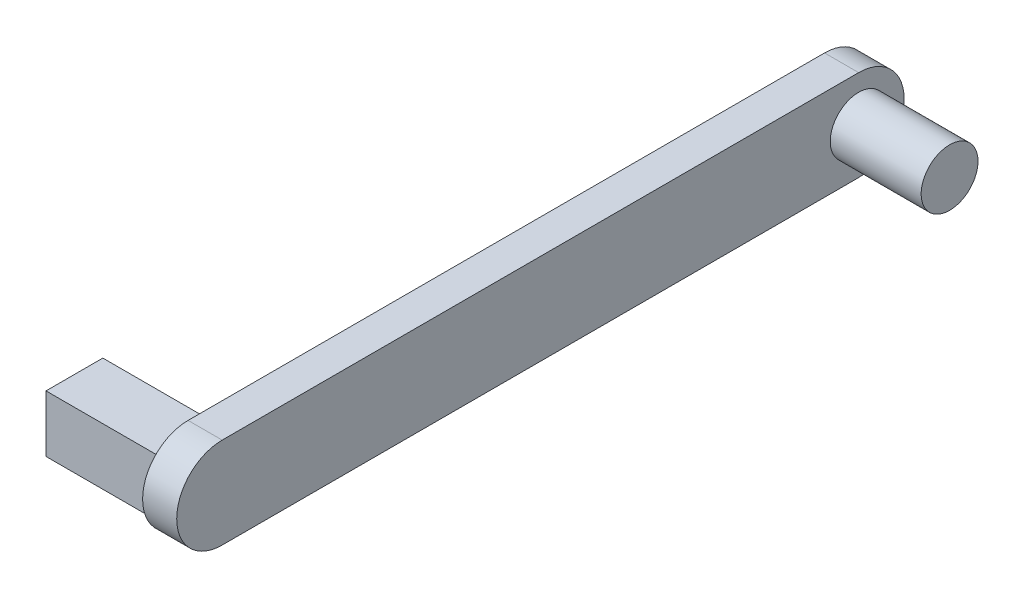
ISO-10303-21;
HEADER;
FILE_DESCRIPTION(('STEP AP214'),'2;1');
FILE_NAME('part.step','',(''),(''),'','','');
FILE_SCHEMA(('AUTOMOTIVE_DESIGN { 1 0 10303 214 1 1 1 1 }'));
ENDSEC;
DATA;
#1=APPLICATION_CONTEXT('core data for automotive mechanical design processes');
#2=APPLICATION_PROTOCOL_DEFINITION('international standard','automotive_design',2000,#1);
#3=PRODUCT_CONTEXT('',#1,'mechanical');
#4=PRODUCT('Part','Part','',(#3));
#5=PRODUCT_RELATED_PRODUCT_CATEGORY('part','',(#4));
#6=PRODUCT_DEFINITION_FORMATION('','',#4);
#7=PRODUCT_DEFINITION_CONTEXT('part definition',#1,'design');
#8=PRODUCT_DEFINITION('design','',#6,#7);
#9=PRODUCT_DEFINITION_SHAPE('','',#8);
#10=(LENGTH_UNIT() NAMED_UNIT(*) SI_UNIT(.MILLI.,.METRE.));
#11=(NAMED_UNIT(*) PLANE_ANGLE_UNIT() SI_UNIT($,.RADIAN.));
#12=(NAMED_UNIT(*) SI_UNIT($,.STERADIAN.) SOLID_ANGLE_UNIT());
#13=UNCERTAINTY_MEASURE_WITH_UNIT(LENGTH_MEASURE(1.E-05),#10,'distance_accuracy_value','');
#14=(GEOMETRIC_REPRESENTATION_CONTEXT(3) GLOBAL_UNCERTAINTY_ASSIGNED_CONTEXT((#13)) GLOBAL_UNIT_ASSIGNED_CONTEXT((#10,
#11,#12)) REPRESENTATION_CONTEXT('',''));
#15=CARTESIAN_POINT('',(0.,0.,0.));
#16=DIRECTION('',(0.,0.,1.));
#17=DIRECTION('',(1.,0.,0.));
#18=AXIS2_PLACEMENT_3D('',#15,#16,#17);
#19=CARTESIAN_POINT('',(-0.762,0.,0.));
#20=DIRECTION('',(1.,0.,0.));
#21=DIRECTION('',(0.,0.,-1.));
#22=AXIS2_PLACEMENT_3D('',#19,#20,#21);
#23=PLANE('',#22);
#24=CARTESIAN_POINT('',(-0.762,0.,0.));
#25=DIRECTION('',(1.,0.,0.));
#26=DIRECTION('',(0.,0.,-1.));
#27=AXIS2_PLACEMENT_3D('',#24,#25,#26);
#28=CIRCLE('',#27,5.08);
#29=CARTESIAN_POINT('',(-0.762,5.08,0.));
#30=VERTEX_POINT('',#29);
#31=CARTESIAN_POINT('',(-0.762,-5.08,0.));
#32=VERTEX_POINT('',#31);
#33=EDGE_CURVE('E132',#30,#32,#28,.T.);
#34=ORIENTED_EDGE('',*,*,#33,.F.);
#35=DIRECTION('',(0.,0.,1.));
#36=VECTOR('',#35,1.);
#37=CARTESIAN_POINT('',(-0.762,5.08,0.));
#38=LINE('',#37,#36);
#39=CARTESIAN_POINT('',(-0.762,5.08,-71.12));
#40=VERTEX_POINT('',#39);
#41=EDGE_CURVE('E142',#40,#30,#38,.T.);
#42=ORIENTED_EDGE('',*,*,#41,.F.);
#43=CARTESIAN_POINT('',(-0.762,0.,-71.12));
#44=DIRECTION('',(1.,0.,0.));
#45=DIRECTION('',(0.,0.,-1.));
#46=AXIS2_PLACEMENT_3D('',#43,#44,#45);
#47=CIRCLE('',#46,5.08);
#48=CARTESIAN_POINT('',(-0.762,-5.08,-71.12));
#49=VERTEX_POINT('',#48);
#50=EDGE_CURVE('E139',#49,#40,#47,.T.);
#51=ORIENTED_EDGE('',*,*,#50,.F.);
#52=DIRECTION('',(0.,0.,-1.));
#53=VECTOR('',#52,1.);
#54=CARTESIAN_POINT('',(-0.762,-5.08,0.));
#55=LINE('',#54,#53);
#56=EDGE_CURVE('E135',#32,#49,#55,.T.);
#57=ORIENTED_EDGE('',*,*,#56,.F.);
#58=EDGE_LOOP('',(#34,#42,#51,#57));
#59=FACE_BOUND('',#58,.T.);
#60=DIRECTION('',(0.,-1.,0.));
#61=VECTOR('',#60,1.);
#62=CARTESIAN_POINT('',(-0.762,3.175,-3.175));
#63=LINE('',#62,#61);
#64=CARTESIAN_POINT('',(-0.762,3.175,-3.175));
#65=VERTEX_POINT('',#64);
#66=CARTESIAN_POINT('',(-0.762,-3.175,-3.175));
#67=VERTEX_POINT('',#66);
#68=EDGE_CURVE('E119',#65,#67,#63,.T.);
#69=ORIENTED_EDGE('',*,*,#68,.F.);
#70=DIRECTION('',(0.,0.,-1.));
#71=VECTOR('',#70,1.);
#72=CARTESIAN_POINT('',(-0.762,3.175,3.175));
#73=LINE('',#72,#71);
#74=CARTESIAN_POINT('',(-0.762,3.175,3.175));
#75=VERTEX_POINT('',#74);
#76=EDGE_CURVE('E116',#75,#65,#73,.T.);
#77=ORIENTED_EDGE('',*,*,#76,.F.);
#78=DIRECTION('',(0.,1.,0.));
#79=VECTOR('',#78,1.);
#80=CARTESIAN_POINT('',(-0.762,3.175,3.175));
#81=LINE('',#80,#79);
#82=CARTESIAN_POINT('',(-0.762,-3.175,3.175));
#83=VERTEX_POINT('',#82);
#84=EDGE_CURVE('E55',#83,#75,#81,.T.);
#85=ORIENTED_EDGE('',*,*,#84,.F.);
#86=DIRECTION('',(0.,0.,1.));
#87=VECTOR('',#86,1.);
#88=CARTESIAN_POINT('',(-0.762,-3.175,3.175));
#89=LINE('',#88,#87);
#90=EDGE_CURVE('E50',#67,#83,#89,.T.);
#91=ORIENTED_EDGE('',*,*,#90,.F.);
#92=EDGE_LOOP('',(#69,#77,#85,#91));
#93=FACE_BOUND('',#92,.T.);
#94=ADVANCED_FACE('F33',(#59,#93),#23,.F.);
#95=CARTESIAN_POINT('',(3.048,0.,0.));
#96=DIRECTION('',(1.,0.,0.));
#97=DIRECTION('',(0.,0.,-1.));
#98=AXIS2_PLACEMENT_3D('',#95,#96,#97);
#99=PLANE('',#98);
#100=CARTESIAN_POINT('',(3.048,0.,0.));
#101=DIRECTION('',(1.,0.,0.));
#102=DIRECTION('',(0.,0.,-1.));
#103=AXIS2_PLACEMENT_3D('',#100,#101,#102);
#104=CIRCLE('',#103,5.08);
#105=CARTESIAN_POINT('',(3.048,5.08,0.));
#106=VERTEX_POINT('',#105);
#107=CARTESIAN_POINT('',(3.048,-5.08,0.));
#108=VERTEX_POINT('',#107);
#109=EDGE_CURVE('E130',#106,#108,#104,.T.);
#110=ORIENTED_EDGE('',*,*,#109,.T.);
#111=DIRECTION('',(0.,0.,-1.));
#112=VECTOR('',#111,1.);
#113=CARTESIAN_POINT('',(3.048,-5.08,0.));
#114=LINE('',#113,#112);
#115=CARTESIAN_POINT('',(3.048,-5.08,-71.12));
#116=VERTEX_POINT('',#115);
#117=EDGE_CURVE('E147',#108,#116,#114,.T.);
#118=ORIENTED_EDGE('',*,*,#117,.T.);
#119=CARTESIAN_POINT('',(3.048,0.,-71.12));
#120=DIRECTION('',(1.,0.,0.));
#121=DIRECTION('',(0.,0.,-1.));
#122=AXIS2_PLACEMENT_3D('',#119,#120,#121);
#123=CIRCLE('',#122,5.08);
#124=CARTESIAN_POINT('',(3.048,5.08,-71.12));
#125=VERTEX_POINT('',#124);
#126=EDGE_CURVE('E150',#116,#125,#123,.T.);
#127=ORIENTED_EDGE('',*,*,#126,.T.);
#128=DIRECTION('',(0.,0.,1.));
#129=VECTOR('',#128,1.);
#130=CARTESIAN_POINT('',(3.048,5.08,0.));
#131=LINE('',#130,#129);
#132=EDGE_CURVE('E136',#125,#106,#131,.T.);
#133=ORIENTED_EDGE('',*,*,#132,.T.);
#134=EDGE_LOOP('',(#110,#118,#127,#133));
#135=FACE_BOUND('',#134,.T.);
#136=CARTESIAN_POINT('',(3.048,0.,-71.12));
#137=DIRECTION('',(1.,0.,0.));
#138=DIRECTION('',(0.,0.,-1.));
#139=AXIS2_PLACEMENT_3D('',#136,#137,#138);
#140=CIRCLE('',#139,3.175);
#141=CARTESIAN_POINT('',(3.048,0.,-74.295));
#142=VERTEX_POINT('',#141);
#143=EDGE_CURVE('E120',#142,#142,#140,.T.);
#144=ORIENTED_EDGE('',*,*,#143,.F.);
#145=EDGE_LOOP('',(#144));
#146=FACE_BOUND('',#145,.T.);
#147=ADVANCED_FACE('F35',(#135,#146),#99,.T.);
#148=CARTESIAN_POINT('',(-0.762,0.,0.));
#149=DIRECTION('',(1.,0.,0.));
#150=DIRECTION('',(0.,0.,-1.));
#151=AXIS2_PLACEMENT_3D('',#148,#149,#150);
#152=CYLINDRICAL_SURFACE('',#151,5.08);
#153=ORIENTED_EDGE('',*,*,#109,.F.);
#154=DIRECTION('',(1.,0.,0.));
#155=VECTOR('',#154,1.);
#156=CARTESIAN_POINT('',(-0.762,5.08,0.));
#157=LINE('',#156,#155);
#158=EDGE_CURVE('E11',#30,#106,#157,.T.);
#159=ORIENTED_EDGE('',*,*,#158,.F.);
#160=ORIENTED_EDGE('',*,*,#33,.T.);
#161=DIRECTION('',(1.,0.,0.));
#162=VECTOR('',#161,1.);
#163=CARTESIAN_POINT('',(-0.762,-5.08,0.));
#164=LINE('',#163,#162);
#165=EDGE_CURVE('E37',#32,#108,#164,.T.);
#166=ORIENTED_EDGE('',*,*,#165,.T.);
#167=EDGE_LOOP('',(#153,#159,#160,#166));
#168=FACE_BOUND('',#167,.T.);
#169=ADVANCED_FACE('F161',(#168),#152,.T.);
#170=CARTESIAN_POINT('',(-0.762,5.08,0.));
#171=DIRECTION('',(0.,1.,0.));
#172=DIRECTION('',(0.,0.,1.));
#173=AXIS2_PLACEMENT_3D('',#170,#171,#172);
#174=PLANE('',#173);
#175=ORIENTED_EDGE('',*,*,#132,.F.);
#176=DIRECTION('',(1.,0.,0.));
#177=VECTOR('',#176,1.);
#178=CARTESIAN_POINT('',(-0.762,5.08,-71.12));
#179=LINE('',#178,#177);
#180=EDGE_CURVE('E42',#40,#125,#179,.T.);
#181=ORIENTED_EDGE('',*,*,#180,.F.);
#182=ORIENTED_EDGE('',*,*,#41,.T.);
#183=ORIENTED_EDGE('',*,*,#158,.T.);
#184=EDGE_LOOP('',(#175,#181,#182,#183));
#185=FACE_BOUND('',#184,.T.);
#186=ADVANCED_FACE('F169',(#185),#174,.T.);
#187=CARTESIAN_POINT('',(-0.762,0.,-71.12));
#188=DIRECTION('',(1.,0.,0.));
#189=DIRECTION('',(0.,0.,-1.));
#190=AXIS2_PLACEMENT_3D('',#187,#188,#189);
#191=CYLINDRICAL_SURFACE('',#190,5.08);
#192=ORIENTED_EDGE('',*,*,#126,.F.);
#193=DIRECTION('',(1.,0.,0.));
#194=VECTOR('',#193,1.);
#195=CARTESIAN_POINT('',(-0.762,-5.08,-71.12));
#196=LINE('',#195,#194);
#197=EDGE_CURVE('E155',#49,#116,#196,.T.);
#198=ORIENTED_EDGE('',*,*,#197,.F.);
#199=ORIENTED_EDGE('',*,*,#50,.T.);
#200=ORIENTED_EDGE('',*,*,#180,.T.);
#201=EDGE_LOOP('',(#192,#198,#199,#200));
#202=FACE_BOUND('',#201,.T.);
#203=ADVANCED_FACE('F174',(#202),#191,.T.);
#204=CARTESIAN_POINT('',(-0.762,-5.08,0.));
#205=DIRECTION('',(0.,-1.,0.));
#206=DIRECTION('',(0.,0.,-1.));
#207=AXIS2_PLACEMENT_3D('',#204,#205,#206);
#208=PLANE('',#207);
#209=ORIENTED_EDGE('',*,*,#117,.F.);
#210=ORIENTED_EDGE('',*,*,#165,.F.);
#211=ORIENTED_EDGE('',*,*,#56,.T.);
#212=ORIENTED_EDGE('',*,*,#197,.T.);
#213=EDGE_LOOP('',(#209,#210,#211,#212));
#214=FACE_BOUND('',#213,.T.);
#215=ADVANCED_FACE('F164',(#214),#208,.T.);
#216=CARTESIAN_POINT('',(13.208,0.,-71.12));
#217=DIRECTION('',(-1.,0.,0.));
#218=DIRECTION('',(0.,0.,1.));
#219=AXIS2_PLACEMENT_3D('',#216,#217,#218);
#220=CYLINDRICAL_SURFACE('',#219,3.175);
#221=CARTESIAN_POINT('',(13.208,0.,-71.12));
#222=DIRECTION('',(1.,0.,0.));
#223=DIRECTION('',(0.,0.,-1.));
#224=AXIS2_PLACEMENT_3D('',#221,#222,#223);
#225=CIRCLE('',#224,3.175);
#226=CARTESIAN_POINT('',(13.208,0.,-74.295));
#227=VERTEX_POINT('',#226);
#228=EDGE_CURVE('E123',#227,#227,#225,.T.);
#229=ORIENTED_EDGE('',*,*,#228,.F.);
#230=EDGE_LOOP('',(#229));
#231=FACE_BOUND('',#230,.T.);
#232=ORIENTED_EDGE('',*,*,#143,.T.);
#233=EDGE_LOOP('',(#232));
#234=FACE_BOUND('',#233,.T.);
#235=ADVANCED_FACE('F181',(#231,#234),#220,.T.);
#236=CARTESIAN_POINT('',(13.208,0.,-71.12));
#237=DIRECTION('',(1.,0.,0.));
#238=DIRECTION('',(0.,0.,-1.));
#239=AXIS2_PLACEMENT_3D('',#236,#237,#238);
#240=PLANE('',#239);
#241=ORIENTED_EDGE('',*,*,#228,.T.);
#242=EDGE_LOOP('',(#241));
#243=FACE_BOUND('',#242,.T.);
#244=ADVANCED_FACE('F192',(#243),#240,.T.);
#245=CARTESIAN_POINT('',(-13.462,3.175,-3.175));
#246=DIRECTION('',(0.,0.,1.));
#247=DIRECTION('',(0.,-1.,0.));
#248=AXIS2_PLACEMENT_3D('',#245,#246,#247);
#249=PLANE('',#248);
#250=ORIENTED_EDGE('',*,*,#68,.T.);
#251=DIRECTION('',(1.,0.,0.));
#252=VECTOR('',#251,1.);
#253=CARTESIAN_POINT('',(-13.462,-3.175,-3.175));
#254=LINE('',#253,#252);
#255=CARTESIAN_POINT('',(-13.462,-3.175,-3.175));
#256=VERTEX_POINT('',#255);
#257=EDGE_CURVE('E100',#256,#67,#254,.T.);
#258=ORIENTED_EDGE('',*,*,#257,.F.);
#259=DIRECTION('',(0.,-1.,0.));
#260=VECTOR('',#259,1.);
#261=CARTESIAN_POINT('',(-13.462,3.175,-3.175));
#262=LINE('',#261,#260);
#263=CARTESIAN_POINT('',(-13.462,3.175,-3.175));
#264=VERTEX_POINT('',#263);
#265=EDGE_CURVE('E107',#264,#256,#262,.T.);
#266=ORIENTED_EDGE('',*,*,#265,.F.);
#267=DIRECTION('',(1.,0.,0.));
#268=VECTOR('',#267,1.);
#269=CARTESIAN_POINT('',(-13.462,3.175,-3.175));
#270=LINE('',#269,#268);
#271=EDGE_CURVE('E290',#264,#65,#270,.T.);
#272=ORIENTED_EDGE('',*,*,#271,.T.);
#273=EDGE_LOOP('',(#250,#258,#266,#272));
#274=FACE_BOUND('',#273,.T.);
#275=ADVANCED_FACE('F118',(#274),#249,.F.);
#276=CARTESIAN_POINT('',(-13.462,-3.175,3.175));
#277=DIRECTION('',(0.,1.,0.));
#278=DIRECTION('',(0.,0.,1.));
#279=AXIS2_PLACEMENT_3D('',#276,#277,#278);
#280=PLANE('',#279);
#281=ORIENTED_EDGE('',*,*,#90,.T.);
#282=DIRECTION('',(1.,0.,0.));
#283=VECTOR('',#282,1.);
#284=CARTESIAN_POINT('',(-13.462,-3.175,3.175));
#285=LINE('',#284,#283);
#286=CARTESIAN_POINT('',(-13.462,-3.175,3.175));
#287=VERTEX_POINT('',#286);
#288=EDGE_CURVE('E103',#287,#83,#285,.T.);
#289=ORIENTED_EDGE('',*,*,#288,.F.);
#290=DIRECTION('',(0.,0.,1.));
#291=VECTOR('',#290,1.);
#292=CARTESIAN_POINT('',(-13.462,-3.175,3.175));
#293=LINE('',#292,#291);
#294=EDGE_CURVE('E96',#256,#287,#293,.T.);
#295=ORIENTED_EDGE('',*,*,#294,.F.);
#296=ORIENTED_EDGE('',*,*,#257,.T.);
#297=EDGE_LOOP('',(#281,#289,#295,#296));
#298=FACE_BOUND('',#297,.T.);
#299=ADVANCED_FACE('F98',(#298),#280,.F.);
#300=CARTESIAN_POINT('',(-13.462,3.175,3.175));
#301=DIRECTION('',(0.,0.,-1.));
#302=DIRECTION('',(0.,1.,0.));
#303=AXIS2_PLACEMENT_3D('',#300,#301,#302);
#304=PLANE('',#303);
#305=ORIENTED_EDGE('',*,*,#84,.T.);
#306=DIRECTION('',(1.,0.,0.));
#307=VECTOR('',#306,1.);
#308=CARTESIAN_POINT('',(-13.462,3.175,3.175));
#309=LINE('',#308,#307);
#310=CARTESIAN_POINT('',(-13.462,3.175,3.175));
#311=VERTEX_POINT('',#310);
#312=EDGE_CURVE('E125',#311,#75,#309,.T.);
#313=ORIENTED_EDGE('',*,*,#312,.F.);
#314=DIRECTION('',(0.,1.,0.));
#315=VECTOR('',#314,1.);
#316=CARTESIAN_POINT('',(-13.462,3.175,3.175));
#317=LINE('',#316,#315);
#318=EDGE_CURVE('E106',#287,#311,#317,.T.);
#319=ORIENTED_EDGE('',*,*,#318,.F.);
#320=ORIENTED_EDGE('',*,*,#288,.T.);
#321=EDGE_LOOP('',(#305,#313,#319,#320));
#322=FACE_BOUND('',#321,.T.);
#323=ADVANCED_FACE('F201',(#322),#304,.F.);
#324=CARTESIAN_POINT('',(-13.462,3.175,3.175));
#325=DIRECTION('',(0.,-1.,0.));
#326=DIRECTION('',(0.,0.,-1.));
#327=AXIS2_PLACEMENT_3D('',#324,#325,#326);
#328=PLANE('',#327);
#329=ORIENTED_EDGE('',*,*,#76,.T.);
#330=ORIENTED_EDGE('',*,*,#271,.F.);
#331=DIRECTION('',(0.,0.,-1.));
#332=VECTOR('',#331,1.);
#333=CARTESIAN_POINT('',(-13.462,3.175,3.175));
#334=LINE('',#333,#332);
#335=EDGE_CURVE('E112',#311,#264,#334,.T.);
#336=ORIENTED_EDGE('',*,*,#335,.F.);
#337=ORIENTED_EDGE('',*,*,#312,.T.);
#338=EDGE_LOOP('',(#329,#330,#336,#337));
#339=FACE_BOUND('',#338,.T.);
#340=ADVANCED_FACE('F204',(#339),#328,.F.);
#341=CARTESIAN_POINT('',(-13.462,0.,0.));
#342=DIRECTION('',(1.,0.,0.));
#343=DIRECTION('',(0.,0.,-1.));
#344=AXIS2_PLACEMENT_3D('',#341,#342,#343);
#345=PLANE('',#344);
#346=ORIENTED_EDGE('',*,*,#265,.T.);
#347=ORIENTED_EDGE('',*,*,#294,.T.);
#348=ORIENTED_EDGE('',*,*,#318,.T.);
#349=ORIENTED_EDGE('',*,*,#335,.T.);
#350=EDGE_LOOP('',(#346,#347,#348,#349));
#351=FACE_BOUND('',#350,.T.);
#352=ADVANCED_FACE('F110',(#351),#345,.F.);
#353=CLOSED_SHELL('',(#94,#147,#169,#186,#203,#215,#235,#244,#275,#299,#323,#340,#352));
#354=MANIFOLD_SOLID_BREP('B2',#353);
#355=ADVANCED_BREP_SHAPE_REPRESENTATION('',(#18,#354),#14);
#356=SHAPE_DEFINITION_REPRESENTATION(#9,#355);
ENDSEC;
END-ISO-10303-21;
